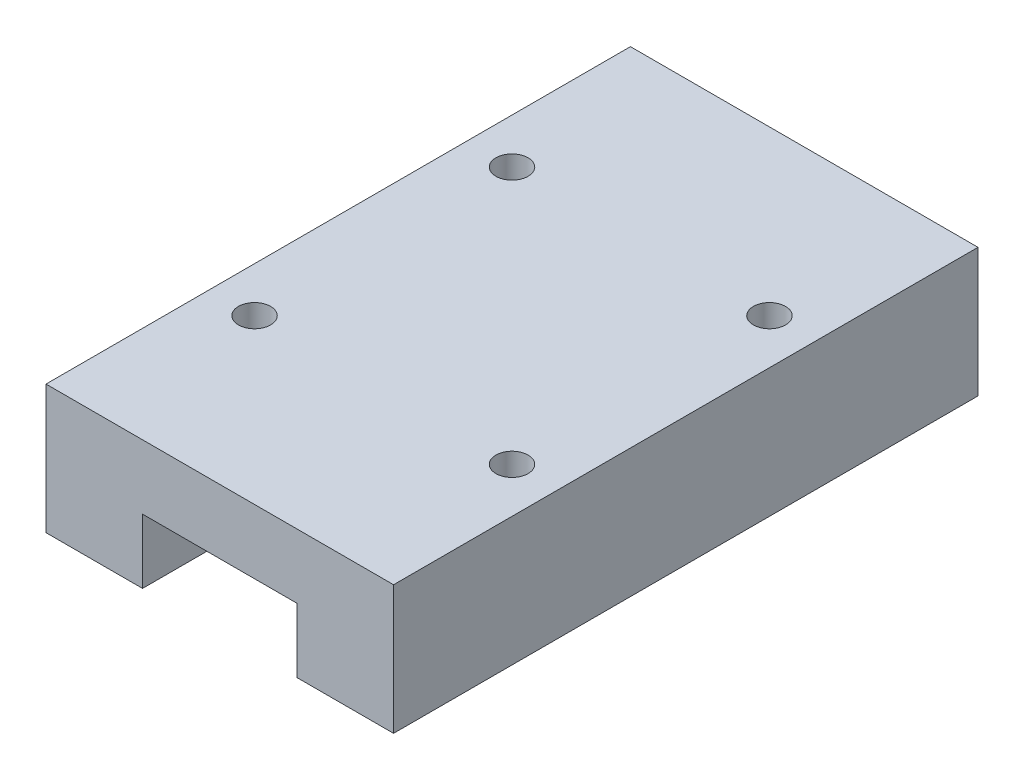
ISO-10303-21;
HEADER;
FILE_DESCRIPTION(('STEP AP214'),'2;1');
FILE_NAME('part.step','',(''),(''),'','','');
FILE_SCHEMA(('AUTOMOTIVE_DESIGN { 1 0 10303 214 1 1 1 1 }'));
ENDSEC;
DATA;
#1=APPLICATION_CONTEXT('core data for automotive mechanical design processes');
#2=APPLICATION_PROTOCOL_DEFINITION('international standard','automotive_design',2000,#1);
#3=PRODUCT_CONTEXT('',#1,'mechanical');
#4=PRODUCT('Part','Part','',(#3));
#5=PRODUCT_RELATED_PRODUCT_CATEGORY('part','',(#4));
#6=PRODUCT_DEFINITION_FORMATION('','',#4);
#7=PRODUCT_DEFINITION_CONTEXT('part definition',#1,'design');
#8=PRODUCT_DEFINITION('design','',#6,#7);
#9=PRODUCT_DEFINITION_SHAPE('','',#8);
#10=(LENGTH_UNIT() NAMED_UNIT(*) SI_UNIT(.MILLI.,.METRE.));
#11=(NAMED_UNIT(*) PLANE_ANGLE_UNIT() SI_UNIT($,.RADIAN.));
#12=(NAMED_UNIT(*) SI_UNIT($,.STERADIAN.) SOLID_ANGLE_UNIT());
#13=UNCERTAINTY_MEASURE_WITH_UNIT(LENGTH_MEASURE(1.E-05),#10,'distance_accuracy_value','');
#14=(GEOMETRIC_REPRESENTATION_CONTEXT(3) GLOBAL_UNCERTAINTY_ASSIGNED_CONTEXT((#13)) GLOBAL_UNIT_ASSIGNED_CONTEXT((#10,
#11,#12)) REPRESENTATION_CONTEXT('',''));
#15=CARTESIAN_POINT('',(0.,0.,0.));
#16=DIRECTION('',(0.,0.,1.));
#17=DIRECTION('',(1.,0.,0.));
#18=AXIS2_PLACEMENT_3D('',#15,#16,#17);
#19=CARTESIAN_POINT('',(7.5,0.,45.4));
#20=DIRECTION('',(0.,1.,0.));
#21=DIRECTION('',(-1.,0.,0.));
#22=AXIS2_PLACEMENT_3D('',#19,#20,#21);
#23=PLANE('',#22);
#24=DIRECTION('',(1.,0.,0.));
#25=VECTOR('',#24,1.);
#26=CARTESIAN_POINT('',(7.5,0.,0.));
#27=LINE('',#26,#25);
#28=CARTESIAN_POINT('',(0.,0.,0.));
#29=VERTEX_POINT('',#28);
#30=CARTESIAN_POINT('',(7.5,0.,0.));
#31=VERTEX_POINT('',#30);
#32=EDGE_CURVE('E172',#29,#31,#27,.T.);
#33=ORIENTED_EDGE('',*,*,#32,.T.);
#34=DIRECTION('',(0.,0.,-1.));
#35=VECTOR('',#34,1.);
#36=CARTESIAN_POINT('',(7.5,0.,45.4));
#37=LINE('',#36,#35);
#38=CARTESIAN_POINT('',(7.5,0.,45.4));
#39=VERTEX_POINT('',#38);
#40=EDGE_CURVE('E11',#39,#31,#37,.T.);
#41=ORIENTED_EDGE('',*,*,#40,.F.);
#42=DIRECTION('',(1.,0.,0.));
#43=VECTOR('',#42,1.);
#44=CARTESIAN_POINT('',(7.5,0.,45.4));
#45=LINE('',#44,#43);
#46=CARTESIAN_POINT('',(0.,0.,45.4));
#47=VERTEX_POINT('',#46);
#48=EDGE_CURVE('E195',#47,#39,#45,.T.);
#49=ORIENTED_EDGE('',*,*,#48,.F.);
#50=DIRECTION('',(0.,0.,-1.));
#51=VECTOR('',#50,1.);
#52=CARTESIAN_POINT('',(0.,0.,45.4));
#53=LINE('',#52,#51);
#54=EDGE_CURVE('E168',#47,#29,#53,.T.);
#55=ORIENTED_EDGE('',*,*,#54,.T.);
#56=EDGE_LOOP('',(#33,#41,#49,#55));
#57=FACE_BOUND('',#56,.T.);
#58=ADVANCED_FACE('F48',(#57),#23,.F.);
#59=CARTESIAN_POINT('',(7.5,5.,45.4));
#60=DIRECTION('',(-1.,0.,0.));
#61=DIRECTION('',(0.,-1.,0.));
#62=AXIS2_PLACEMENT_3D('',#59,#60,#61);
#63=PLANE('',#62);
#64=DIRECTION('',(0.,1.,0.));
#65=VECTOR('',#64,1.);
#66=CARTESIAN_POINT('',(7.5,5.,0.));
#67=LINE('',#66,#65);
#68=CARTESIAN_POINT('',(7.5,5.,0.));
#69=VERTEX_POINT('',#68);
#70=EDGE_CURVE('E176',#31,#69,#67,.T.);
#71=ORIENTED_EDGE('',*,*,#70,.T.);
#72=DIRECTION('',(0.,0.,-1.));
#73=VECTOR('',#72,1.);
#74=CARTESIAN_POINT('',(7.5,5.,45.4));
#75=LINE('',#74,#73);
#76=CARTESIAN_POINT('',(7.5,5.,45.4));
#77=VERTEX_POINT('',#76);
#78=EDGE_CURVE('E57',#77,#69,#75,.T.);
#79=ORIENTED_EDGE('',*,*,#78,.F.);
#80=DIRECTION('',(0.,1.,0.));
#81=VECTOR('',#80,1.);
#82=CARTESIAN_POINT('',(7.5,5.,45.4));
#83=LINE('',#82,#81);
#84=EDGE_CURVE('E123',#39,#77,#83,.T.);
#85=ORIENTED_EDGE('',*,*,#84,.F.);
#86=ORIENTED_EDGE('',*,*,#40,.T.);
#87=EDGE_LOOP('',(#71,#79,#85,#86));
#88=FACE_BOUND('',#87,.T.);
#89=ADVANCED_FACE('F302',(#88),#63,.F.);
#90=CARTESIAN_POINT('',(19.5,5.,45.4));
#91=DIRECTION('',(0.,1.,0.));
#92=DIRECTION('',(-1.,0.,0.));
#93=AXIS2_PLACEMENT_3D('',#90,#91,#92);
#94=PLANE('',#93);
#95=DIRECTION('',(1.,0.,0.));
#96=VECTOR('',#95,1.);
#97=CARTESIAN_POINT('',(19.5,5.,0.));
#98=LINE('',#97,#96);
#99=CARTESIAN_POINT('',(19.5,5.,0.));
#100=VERTEX_POINT('',#99);
#101=EDGE_CURVE('E180',#69,#100,#98,.T.);
#102=ORIENTED_EDGE('',*,*,#101,.T.);
#103=DIRECTION('',(0.,0.,-1.));
#104=VECTOR('',#103,1.);
#105=CARTESIAN_POINT('',(19.5,5.,45.4));
#106=LINE('',#105,#104);
#107=CARTESIAN_POINT('',(19.5,5.,45.4));
#108=VERTEX_POINT('',#107);
#109=EDGE_CURVE('E205',#108,#100,#106,.T.);
#110=ORIENTED_EDGE('',*,*,#109,.F.);
#111=DIRECTION('',(1.,0.,0.));
#112=VECTOR('',#111,1.);
#113=CARTESIAN_POINT('',(19.5,5.,45.4));
#114=LINE('',#113,#112);
#115=EDGE_CURVE('E216',#77,#108,#114,.T.);
#116=ORIENTED_EDGE('',*,*,#115,.F.);
#117=ORIENTED_EDGE('',*,*,#78,.T.);
#118=EDGE_LOOP('',(#102,#110,#116,#117));
#119=FACE_BOUND('',#118,.T.);
#120=ADVANCED_FACE('F214',(#119),#94,.F.);
#121=CARTESIAN_POINT('',(19.5,0.,45.4));
#122=DIRECTION('',(1.,0.,0.));
#123=DIRECTION('',(0.,0.,-1.));
#124=AXIS2_PLACEMENT_3D('',#121,#122,#123);
#125=PLANE('',#124);
#126=DIRECTION('',(0.,-1.,0.));
#127=VECTOR('',#126,1.);
#128=CARTESIAN_POINT('',(19.5,0.,0.));
#129=LINE('',#128,#127);
#130=CARTESIAN_POINT('',(19.5,0.,0.));
#131=VERTEX_POINT('',#130);
#132=EDGE_CURVE('E183',#100,#131,#129,.T.);
#133=ORIENTED_EDGE('',*,*,#132,.T.);
#134=DIRECTION('',(0.,0.,-1.));
#135=VECTOR('',#134,1.);
#136=CARTESIAN_POINT('',(19.5,0.,45.4));
#137=LINE('',#136,#135);
#138=CARTESIAN_POINT('',(19.5,0.,45.4));
#139=VERTEX_POINT('',#138);
#140=EDGE_CURVE('E201',#139,#131,#137,.T.);
#141=ORIENTED_EDGE('',*,*,#140,.F.);
#142=DIRECTION('',(0.,-1.,0.));
#143=VECTOR('',#142,1.);
#144=CARTESIAN_POINT('',(19.5,0.,45.4));
#145=LINE('',#144,#143);
#146=EDGE_CURVE('E229',#108,#139,#145,.T.);
#147=ORIENTED_EDGE('',*,*,#146,.F.);
#148=ORIENTED_EDGE('',*,*,#109,.T.);
#149=EDGE_LOOP('',(#133,#141,#147,#148));
#150=FACE_BOUND('',#149,.T.);
#151=ADVANCED_FACE('F224',(#150),#125,.F.);
#152=CARTESIAN_POINT('',(27.,0.,45.4));
#153=DIRECTION('',(0.,1.,0.));
#154=DIRECTION('',(-1.,0.,0.));
#155=AXIS2_PLACEMENT_3D('',#152,#153,#154);
#156=PLANE('',#155);
#157=DIRECTION('',(1.,0.,0.));
#158=VECTOR('',#157,1.);
#159=CARTESIAN_POINT('',(27.,0.,0.));
#160=LINE('',#159,#158);
#161=CARTESIAN_POINT('',(27.,0.,0.));
#162=VERTEX_POINT('',#161);
#163=EDGE_CURVE('E186',#131,#162,#160,.T.);
#164=ORIENTED_EDGE('',*,*,#163,.T.);
#165=DIRECTION('',(0.,0.,-1.));
#166=VECTOR('',#165,1.);
#167=CARTESIAN_POINT('',(27.,0.,45.4));
#168=LINE('',#167,#166);
#169=CARTESIAN_POINT('',(27.,0.,45.4));
#170=VERTEX_POINT('',#169);
#171=EDGE_CURVE('E159',#170,#162,#168,.T.);
#172=ORIENTED_EDGE('',*,*,#171,.F.);
#173=DIRECTION('',(1.,0.,0.));
#174=VECTOR('',#173,1.);
#175=CARTESIAN_POINT('',(27.,0.,45.4));
#176=LINE('',#175,#174);
#177=EDGE_CURVE('E148',#139,#170,#176,.T.);
#178=ORIENTED_EDGE('',*,*,#177,.F.);
#179=ORIENTED_EDGE('',*,*,#140,.T.);
#180=EDGE_LOOP('',(#164,#172,#178,#179));
#181=FACE_BOUND('',#180,.T.);
#182=ADVANCED_FACE('F227',(#181),#156,.F.);
#183=CARTESIAN_POINT('',(27.,10.,45.4));
#184=DIRECTION('',(-1.,0.,0.));
#185=DIRECTION('',(0.,0.,1.));
#186=AXIS2_PLACEMENT_3D('',#183,#184,#185);
#187=PLANE('',#186);
#188=DIRECTION('',(0.,1.,0.));
#189=VECTOR('',#188,1.);
#190=CARTESIAN_POINT('',(27.,10.,0.));
#191=LINE('',#190,#189);
#192=CARTESIAN_POINT('',(27.,10.,0.));
#193=VERTEX_POINT('',#192);
#194=EDGE_CURVE('E157',#162,#193,#191,.T.);
#195=ORIENTED_EDGE('',*,*,#194,.T.);
#196=DIRECTION('',(0.,0.,-1.));
#197=VECTOR('',#196,1.);
#198=CARTESIAN_POINT('',(27.,10.,45.4));
#199=LINE('',#198,#197);
#200=CARTESIAN_POINT('',(27.,10.,45.4));
#201=VERTEX_POINT('',#200);
#202=EDGE_CURVE('E154',#201,#193,#199,.T.);
#203=ORIENTED_EDGE('',*,*,#202,.F.);
#204=DIRECTION('',(0.,1.,0.));
#205=VECTOR('',#204,1.);
#206=CARTESIAN_POINT('',(27.,10.,45.4));
#207=LINE('',#206,#205);
#208=EDGE_CURVE('E142',#170,#201,#207,.T.);
#209=ORIENTED_EDGE('',*,*,#208,.F.);
#210=ORIENTED_EDGE('',*,*,#171,.T.);
#211=EDGE_LOOP('',(#195,#203,#209,#210));
#212=FACE_BOUND('',#211,.T.);
#213=ADVANCED_FACE('F155',(#212),#187,.F.);
#214=CARTESIAN_POINT('',(0.,10.,45.4));
#215=DIRECTION('',(0.,-1.,0.));
#216=DIRECTION('',(1.,0.,0.));
#217=AXIS2_PLACEMENT_3D('',#214,#215,#216);
#218=PLANE('',#217);
#219=CARTESIAN_POINT('',(3.5,10.,12.7));
#220=DIRECTION('',(0.,1.,0.));
#221=DIRECTION('',(0.,0.,1.));
#222=AXIS2_PLACEMENT_3D('',#219,#220,#221);
#223=CIRCLE('',#222,1.24999999999999);
#224=CARTESIAN_POINT('',(3.5,10.,13.95));
#225=VERTEX_POINT('',#224);
#226=EDGE_CURVE('E267',#225,#225,#223,.T.);
#227=ORIENTED_EDGE('',*,*,#226,.F.);
#228=EDGE_LOOP('',(#227));
#229=FACE_BOUND('',#228,.T.);
#230=CARTESIAN_POINT('',(3.50000000000004,10.,32.7));
#231=DIRECTION('',(0.,1.,0.));
#232=DIRECTION('',(0.,0.,1.));
#233=AXIS2_PLACEMENT_3D('',#230,#231,#232);
#234=CIRCLE('',#233,1.24999999999999);
#235=CARTESIAN_POINT('',(3.50000000000004,10.,33.95));
#236=VERTEX_POINT('',#235);
#237=EDGE_CURVE('E259',#236,#236,#234,.T.);
#238=ORIENTED_EDGE('',*,*,#237,.F.);
#239=EDGE_LOOP('',(#238));
#240=FACE_BOUND('',#239,.T.);
#241=CARTESIAN_POINT('',(23.5,10.,32.7));
#242=DIRECTION('',(0.,1.,0.));
#243=DIRECTION('',(0.,0.,1.));
#244=AXIS2_PLACEMENT_3D('',#241,#242,#243);
#245=CIRCLE('',#244,1.24999999999999);
#246=CARTESIAN_POINT('',(23.5,10.,33.95));
#247=VERTEX_POINT('',#246);
#248=EDGE_CURVE('E251',#247,#247,#245,.T.);
#249=ORIENTED_EDGE('',*,*,#248,.F.);
#250=EDGE_LOOP('',(#249));
#251=FACE_BOUND('',#250,.T.);
#252=CARTESIAN_POINT('',(23.5,10.,12.7));
#253=DIRECTION('',(0.,1.,0.));
#254=DIRECTION('',(0.,0.,1.));
#255=AXIS2_PLACEMENT_3D('',#252,#253,#254);
#256=CIRCLE('',#255,1.24999999999999);
#257=CARTESIAN_POINT('',(23.5,10.,13.95));
#258=VERTEX_POINT('',#257);
#259=EDGE_CURVE('E243',#258,#258,#256,.T.);
#260=ORIENTED_EDGE('',*,*,#259,.F.);
#261=EDGE_LOOP('',(#260));
#262=FACE_BOUND('',#261,.T.);
#263=DIRECTION('',(-1.,0.,0.));
#264=VECTOR('',#263,1.);
#265=CARTESIAN_POINT('',(0.,10.,0.));
#266=LINE('',#265,#264);
#267=CARTESIAN_POINT('',(0.,10.,0.));
#268=VERTEX_POINT('',#267);
#269=EDGE_CURVE('E107',#193,#268,#266,.T.);
#270=ORIENTED_EDGE('',*,*,#269,.T.);
#271=DIRECTION('',(0.,0.,-1.));
#272=VECTOR('',#271,1.);
#273=CARTESIAN_POINT('',(0.,10.,45.4));
#274=LINE('',#273,#272);
#275=CARTESIAN_POINT('',(0.,10.,45.4));
#276=VERTEX_POINT('',#275);
#277=EDGE_CURVE('E160',#276,#268,#274,.T.);
#278=ORIENTED_EDGE('',*,*,#277,.F.);
#279=DIRECTION('',(-1.,0.,0.));
#280=VECTOR('',#279,1.);
#281=CARTESIAN_POINT('',(0.,10.,45.4));
#282=LINE('',#281,#280);
#283=EDGE_CURVE('E146',#201,#276,#282,.T.);
#284=ORIENTED_EDGE('',*,*,#283,.F.);
#285=ORIENTED_EDGE('',*,*,#202,.T.);
#286=EDGE_LOOP('',(#270,#278,#284,#285));
#287=FACE_BOUND('',#286,.T.);
#288=ADVANCED_FACE('F162',(#229,#240,#251,#262,#287),#218,.F.);
#289=CARTESIAN_POINT('',(0.,0.,45.4));
#290=DIRECTION('',(1.,0.,0.));
#291=DIRECTION('',(0.,0.,-1.));
#292=AXIS2_PLACEMENT_3D('',#289,#290,#291);
#293=PLANE('',#292);
#294=DIRECTION('',(0.,-1.,0.));
#295=VECTOR('',#294,1.);
#296=CARTESIAN_POINT('',(0.,0.,0.));
#297=LINE('',#296,#295);
#298=EDGE_CURVE('E114',#268,#29,#297,.T.);
#299=ORIENTED_EDGE('',*,*,#298,.T.);
#300=ORIENTED_EDGE('',*,*,#54,.F.);
#301=DIRECTION('',(0.,-1.,0.));
#302=VECTOR('',#301,1.);
#303=CARTESIAN_POINT('',(0.,0.,45.4));
#304=LINE('',#303,#302);
#305=EDGE_CURVE('E68',#276,#47,#304,.T.);
#306=ORIENTED_EDGE('',*,*,#305,.F.);
#307=ORIENTED_EDGE('',*,*,#277,.T.);
#308=EDGE_LOOP('',(#299,#300,#306,#307));
#309=FACE_BOUND('',#308,.T.);
#310=ADVANCED_FACE('F277',(#309),#293,.F.);
#311=CARTESIAN_POINT('',(0.,0.,45.4));
#312=DIRECTION('',(0.,0.,-1.));
#313=DIRECTION('',(-1.,0.,0.));
#314=AXIS2_PLACEMENT_3D('',#311,#312,#313);
#315=PLANE('',#314);
#316=ORIENTED_EDGE('',*,*,#48,.T.);
#317=ORIENTED_EDGE('',*,*,#84,.T.);
#318=ORIENTED_EDGE('',*,*,#115,.T.);
#319=ORIENTED_EDGE('',*,*,#146,.T.);
#320=ORIENTED_EDGE('',*,*,#177,.T.);
#321=ORIENTED_EDGE('',*,*,#208,.T.);
#322=ORIENTED_EDGE('',*,*,#283,.T.);
#323=ORIENTED_EDGE('',*,*,#305,.T.);
#324=EDGE_LOOP('',(#316,#317,#318,#319,#320,#321,#322,#323));
#325=FACE_BOUND('',#324,.T.);
#326=ADVANCED_FACE('F144',(#325),#315,.F.);
#327=CARTESIAN_POINT('',(0.,0.,0.));
#328=DIRECTION('',(0.,0.,-1.));
#329=DIRECTION('',(-1.,0.,0.));
#330=AXIS2_PLACEMENT_3D('',#327,#328,#329);
#331=PLANE('',#330);
#332=ORIENTED_EDGE('',*,*,#32,.F.);
#333=ORIENTED_EDGE('',*,*,#298,.F.);
#334=ORIENTED_EDGE('',*,*,#269,.F.);
#335=ORIENTED_EDGE('',*,*,#194,.F.);
#336=ORIENTED_EDGE('',*,*,#163,.F.);
#337=ORIENTED_EDGE('',*,*,#132,.F.);
#338=ORIENTED_EDGE('',*,*,#101,.F.);
#339=ORIENTED_EDGE('',*,*,#70,.F.);
#340=EDGE_LOOP('',(#332,#333,#334,#335,#336,#337,#338,#339));
#341=FACE_BOUND('',#340,.T.);
#342=ADVANCED_FACE('F220',(#341),#331,.T.);
#343=CARTESIAN_POINT('',(23.5,4.,12.7));
#344=DIRECTION('',(0.,1.,0.));
#345=DIRECTION('',(0.,0.,1.));
#346=AXIS2_PLACEMENT_3D('',#343,#344,#345);
#347=CONICAL_SURFACE('',#346,1.25,1.02974425867665);
#348=CARTESIAN_POINT('',(23.5,3.24892422621555,12.7));
#349=VERTEX_POINT('',#348);
#350=VERTEX_LOOP('',#349);
#351=FACE_BOUND('',#350,.T.);
#352=CARTESIAN_POINT('',(23.5,4.,12.7));
#353=DIRECTION('',(0.,1.,0.));
#354=DIRECTION('',(0.,0.,1.));
#355=AXIS2_PLACEMENT_3D('',#352,#353,#354);
#356=CIRCLE('',#355,1.25);
#357=CARTESIAN_POINT('',(23.5,4.,13.95));
#358=VERTEX_POINT('',#357);
#359=EDGE_CURVE('E177',#358,#358,#356,.T.);
#360=ORIENTED_EDGE('',*,*,#359,.T.);
#361=EDGE_LOOP('',(#360));
#362=FACE_BOUND('',#361,.T.);
#363=ADVANCED_FACE('F288',(#351,#362),#347,.F.);
#364=CARTESIAN_POINT('',(23.5,10.,12.7));
#365=DIRECTION('',(0.,1.,0.));
#366=DIRECTION('',(0.,0.,1.));
#367=AXIS2_PLACEMENT_3D('',#364,#365,#366);
#368=CYLINDRICAL_SURFACE('',#367,1.24999999999999);
#369=ORIENTED_EDGE('',*,*,#359,.F.);
#370=EDGE_LOOP('',(#369));
#371=FACE_BOUND('',#370,.T.);
#372=ORIENTED_EDGE('',*,*,#259,.T.);
#373=EDGE_LOOP('',(#372));
#374=FACE_BOUND('',#373,.T.);
#375=ADVANCED_FACE('F285',(#371,#374),#368,.F.);
#376=CARTESIAN_POINT('',(23.5,4.,32.7));
#377=DIRECTION('',(0.,1.,0.));
#378=DIRECTION('',(0.,0.,1.));
#379=AXIS2_PLACEMENT_3D('',#376,#377,#378);
#380=CONICAL_SURFACE('',#379,1.25,1.02974425867665);
#381=CARTESIAN_POINT('',(23.5,3.24892422621555,32.7));
#382=VERTEX_POINT('',#381);
#383=VERTEX_LOOP('',#382);
#384=FACE_BOUND('',#383,.T.);
#385=CARTESIAN_POINT('',(23.5,4.,32.7));
#386=DIRECTION('',(0.,1.,0.));
#387=DIRECTION('',(0.,0.,1.));
#388=AXIS2_PLACEMENT_3D('',#385,#386,#387);
#389=CIRCLE('',#388,1.25);
#390=CARTESIAN_POINT('',(23.5,4.,33.95));
#391=VERTEX_POINT('',#390);
#392=EDGE_CURVE('E247',#391,#391,#389,.T.);
#393=ORIENTED_EDGE('',*,*,#392,.T.);
#394=EDGE_LOOP('',(#393));
#395=FACE_BOUND('',#394,.T.);
#396=ADVANCED_FACE('F287',(#384,#395),#380,.F.);
#397=CARTESIAN_POINT('',(23.5,10.,32.7));
#398=DIRECTION('',(0.,1.,0.));
#399=DIRECTION('',(0.,0.,1.));
#400=AXIS2_PLACEMENT_3D('',#397,#398,#399);
#401=CYLINDRICAL_SURFACE('',#400,1.24999999999999);
#402=ORIENTED_EDGE('',*,*,#392,.F.);
#403=EDGE_LOOP('',(#402));
#404=FACE_BOUND('',#403,.T.);
#405=ORIENTED_EDGE('',*,*,#248,.T.);
#406=EDGE_LOOP('',(#405));
#407=FACE_BOUND('',#406,.T.);
#408=ADVANCED_FACE('F295',(#404,#407),#401,.F.);
#409=CARTESIAN_POINT('',(3.50000000000004,4.,32.7));
#410=DIRECTION('',(0.,1.,0.));
#411=DIRECTION('',(0.,0.,1.));
#412=AXIS2_PLACEMENT_3D('',#409,#410,#411);
#413=CONICAL_SURFACE('',#412,1.25,1.02974425867665);
#414=CARTESIAN_POINT('',(3.50000000000004,3.24892422621555,32.7));
#415=VERTEX_POINT('',#414);
#416=VERTEX_LOOP('',#415);
#417=FACE_BOUND('',#416,.T.);
#418=CARTESIAN_POINT('',(3.50000000000004,4.,32.7));
#419=DIRECTION('',(0.,1.,0.));
#420=DIRECTION('',(0.,0.,1.));
#421=AXIS2_PLACEMENT_3D('',#418,#419,#420);
#422=CIRCLE('',#421,1.25);
#423=CARTESIAN_POINT('',(3.50000000000004,4.,33.95));
#424=VERTEX_POINT('',#423);
#425=EDGE_CURVE('E255',#424,#424,#422,.T.);
#426=ORIENTED_EDGE('',*,*,#425,.T.);
#427=EDGE_LOOP('',(#426));
#428=FACE_BOUND('',#427,.T.);
#429=ADVANCED_FACE('F359',(#417,#428),#413,.F.);
#430=CARTESIAN_POINT('',(3.50000000000004,10.,32.7));
#431=DIRECTION('',(0.,1.,0.));
#432=DIRECTION('',(0.,0.,1.));
#433=AXIS2_PLACEMENT_3D('',#430,#431,#432);
#434=CYLINDRICAL_SURFACE('',#433,1.24999999999999);
#435=ORIENTED_EDGE('',*,*,#425,.F.);
#436=EDGE_LOOP('',(#435));
#437=FACE_BOUND('',#436,.T.);
#438=ORIENTED_EDGE('',*,*,#237,.T.);
#439=EDGE_LOOP('',(#438));
#440=FACE_BOUND('',#439,.T.);
#441=ADVANCED_FACE('F366',(#437,#440),#434,.F.);
#442=CARTESIAN_POINT('',(3.5,4.,12.7));
#443=DIRECTION('',(0.,1.,0.));
#444=DIRECTION('',(0.,0.,1.));
#445=AXIS2_PLACEMENT_3D('',#442,#443,#444);
#446=CONICAL_SURFACE('',#445,1.25,1.02974425867665);
#447=CARTESIAN_POINT('',(3.5,3.24892422621555,12.7));
#448=VERTEX_POINT('',#447);
#449=VERTEX_LOOP('',#448);
#450=FACE_BOUND('',#449,.T.);
#451=CARTESIAN_POINT('',(3.5,4.,12.7));
#452=DIRECTION('',(0.,1.,0.));
#453=DIRECTION('',(0.,0.,1.));
#454=AXIS2_PLACEMENT_3D('',#451,#452,#453);
#455=CIRCLE('',#454,1.25);
#456=CARTESIAN_POINT('',(3.5,4.,13.95));
#457=VERTEX_POINT('',#456);
#458=EDGE_CURVE('E263',#457,#457,#455,.T.);
#459=ORIENTED_EDGE('',*,*,#458,.T.);
#460=EDGE_LOOP('',(#459));
#461=FACE_BOUND('',#460,.T.);
#462=ADVANCED_FACE('F371',(#450,#461),#446,.F.);
#463=CARTESIAN_POINT('',(3.5,10.,12.7));
#464=DIRECTION('',(0.,1.,0.));
#465=DIRECTION('',(0.,0.,1.));
#466=AXIS2_PLACEMENT_3D('',#463,#464,#465);
#467=CYLINDRICAL_SURFACE('',#466,1.24999999999999);
#468=ORIENTED_EDGE('',*,*,#458,.F.);
#469=EDGE_LOOP('',(#468));
#470=FACE_BOUND('',#469,.T.);
#471=ORIENTED_EDGE('',*,*,#226,.T.);
#472=EDGE_LOOP('',(#471));
#473=FACE_BOUND('',#472,.T.);
#474=ADVANCED_FACE('F273',(#470,#473),#467,.F.);
#475=CLOSED_SHELL('',(#58,#89,#120,#151,#182,#213,#288,#310,#326,#342,#363,#375,#396,#408,#429,
#441,#462,#474));
#476=MANIFOLD_SOLID_BREP('B2',#475);
#477=ADVANCED_BREP_SHAPE_REPRESENTATION('',(#18,#476),#14);
#478=SHAPE_DEFINITION_REPRESENTATION(#9,#477);
ENDSEC;
END-ISO-10303-21;
